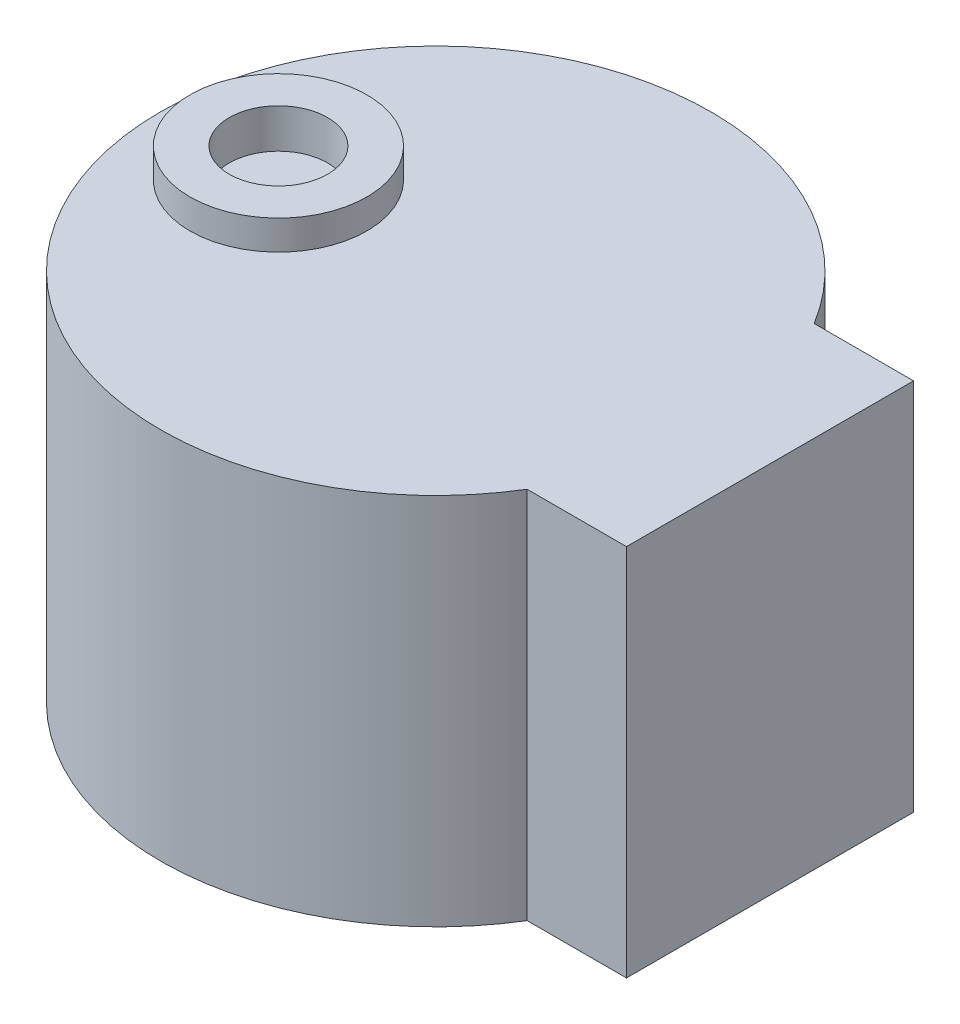
ISO-10303-21;
HEADER;
FILE_DESCRIPTION(('STEP AP214'),'2;1');
FILE_NAME('part.step','',(''),(''),'','','');
FILE_SCHEMA(('AUTOMOTIVE_DESIGN { 1 0 10303 214 1 1 1 1 }'));
ENDSEC;
DATA;
#1=APPLICATION_CONTEXT('core data for automotive mechanical design processes');
#2=APPLICATION_PROTOCOL_DEFINITION('international standard','automotive_design',2000,#1);
#3=PRODUCT_CONTEXT('',#1,'mechanical');
#4=PRODUCT('Part','Part','',(#3));
#5=PRODUCT_RELATED_PRODUCT_CATEGORY('part','',(#4));
#6=PRODUCT_DEFINITION_FORMATION('','',#4);
#7=PRODUCT_DEFINITION_CONTEXT('part definition',#1,'design');
#8=PRODUCT_DEFINITION('design','',#6,#7);
#9=PRODUCT_DEFINITION_SHAPE('','',#8);
#10=(LENGTH_UNIT() NAMED_UNIT(*) SI_UNIT(.MILLI.,.METRE.));
#11=(NAMED_UNIT(*) PLANE_ANGLE_UNIT() SI_UNIT($,.RADIAN.));
#12=(NAMED_UNIT(*) SI_UNIT($,.STERADIAN.) SOLID_ANGLE_UNIT());
#13=UNCERTAINTY_MEASURE_WITH_UNIT(LENGTH_MEASURE(1.E-05),#10,'distance_accuracy_value','');
#14=(GEOMETRIC_REPRESENTATION_CONTEXT(3) GLOBAL_UNCERTAINTY_ASSIGNED_CONTEXT((#13)) GLOBAL_UNIT_ASSIGNED_CONTEXT((#10,
#11,#12)) REPRESENTATION_CONTEXT('',''));
#15=CARTESIAN_POINT('',(0.,0.,0.));
#16=DIRECTION('',(0.,0.,1.));
#17=DIRECTION('',(1.,0.,0.));
#18=AXIS2_PLACEMENT_3D('',#15,#16,#17);
#19=CARTESIAN_POINT('',(0.,19.,-7.3));
#20=DIRECTION('',(0.,0.,-1.));
#21=DIRECTION('',(-1.,0.,0.));
#22=AXIS2_PLACEMENT_3D('',#19,#20,#21);
#23=PLANE('',#22);
#24=DIRECTION('',(1.,0.,0.));
#25=VECTOR('',#24,1.);
#26=CARTESIAN_POINT('',(0.,0.,-7.3));
#27=LINE('',#26,#25);
#28=CARTESIAN_POINT('',(11.9461290801665,0.,-7.3));
#29=VERTEX_POINT('',#28);
#30=CARTESIAN_POINT('',(17.,0.,-7.3));
#31=VERTEX_POINT('',#30);
#32=EDGE_CURVE('E107',#29,#31,#27,.T.);
#33=ORIENTED_EDGE('',*,*,#32,.F.);
#34=DIRECTION('',(0.,-1.,0.));
#35=VECTOR('',#34,1.);
#36=CARTESIAN_POINT('',(11.9461290801665,19.,-7.3));
#37=LINE('',#36,#35);
#38=CARTESIAN_POINT('',(11.9461290801665,19.,-7.3));
#39=VERTEX_POINT('',#38);
#40=EDGE_CURVE('E11',#39,#29,#37,.T.);
#41=ORIENTED_EDGE('',*,*,#40,.F.);
#42=DIRECTION('',(1.,0.,0.));
#43=VECTOR('',#42,1.);
#44=CARTESIAN_POINT('',(0.,19.,-7.3));
#45=LINE('',#44,#43);
#46=CARTESIAN_POINT('',(17.,19.,-7.3));
#47=VERTEX_POINT('',#46);
#48=EDGE_CURVE('E91',#39,#47,#45,.T.);
#49=ORIENTED_EDGE('',*,*,#48,.T.);
#50=DIRECTION('',(0.,-1.,0.));
#51=VECTOR('',#50,1.);
#52=CARTESIAN_POINT('',(17.,19.,-7.3));
#53=LINE('',#52,#51);
#54=EDGE_CURVE('E80',#47,#31,#53,.T.);
#55=ORIENTED_EDGE('',*,*,#54,.T.);
#56=EDGE_LOOP('',(#33,#41,#49,#55));
#57=FACE_BOUND('',#56,.T.);
#58=ADVANCED_FACE('F40',(#57),#23,.T.);
#59=CARTESIAN_POINT('',(0.,19.,0.));
#60=DIRECTION('',(0.,-1.,0.));
#61=DIRECTION('',(0.,0.,-1.));
#62=AXIS2_PLACEMENT_3D('',#59,#60,#61);
#63=CYLINDRICAL_SURFACE('',#62,14.);
#64=CARTESIAN_POINT('',(0.,0.,0.));
#65=DIRECTION('',(0.,1.,0.));
#66=DIRECTION('',(0.,0.,1.));
#67=AXIS2_PLACEMENT_3D('',#64,#65,#66);
#68=CIRCLE('',#67,14.);
#69=CARTESIAN_POINT('',(11.9461290801665,0.,7.3));
#70=VERTEX_POINT('',#69);
#71=EDGE_CURVE('E97',#29,#70,#68,.T.);
#72=ORIENTED_EDGE('',*,*,#71,.T.);
#73=DIRECTION('',(0.,-1.,0.));
#74=VECTOR('',#73,1.);
#75=CARTESIAN_POINT('',(11.9461290801665,19.,7.3));
#76=LINE('',#75,#74);
#77=CARTESIAN_POINT('',(11.9461290801665,19.,7.3));
#78=VERTEX_POINT('',#77);
#79=EDGE_CURVE('E49',#78,#70,#76,.T.);
#80=ORIENTED_EDGE('',*,*,#79,.F.);
#81=CARTESIAN_POINT('',(0.,19.,0.));
#82=DIRECTION('',(0.,1.,0.));
#83=DIRECTION('',(0.,0.,1.));
#84=AXIS2_PLACEMENT_3D('',#81,#82,#83);
#85=CIRCLE('',#84,14.);
#86=EDGE_CURVE('E86',#39,#78,#85,.T.);
#87=ORIENTED_EDGE('',*,*,#86,.F.);
#88=ORIENTED_EDGE('',*,*,#40,.T.);
#89=EDGE_LOOP('',(#72,#80,#87,#88));
#90=FACE_BOUND('',#89,.T.);
#91=ADVANCED_FACE('F95',(#90),#63,.T.);
#92=CARTESIAN_POINT('',(0.,19.,7.3));
#93=DIRECTION('',(0.,0.,-1.));
#94=DIRECTION('',(-1.,0.,0.));
#95=AXIS2_PLACEMENT_3D('',#92,#93,#94);
#96=PLANE('',#95);
#97=DIRECTION('',(1.,0.,0.));
#98=VECTOR('',#97,1.);
#99=CARTESIAN_POINT('',(0.,0.,7.3));
#100=LINE('',#99,#98);
#101=CARTESIAN_POINT('',(17.,0.,7.3));
#102=VERTEX_POINT('',#101);
#103=EDGE_CURVE('E73',#70,#102,#100,.T.);
#104=ORIENTED_EDGE('',*,*,#103,.T.);
#105=DIRECTION('',(0.,-1.,0.));
#106=VECTOR('',#105,1.);
#107=CARTESIAN_POINT('',(17.,19.,7.3));
#108=LINE('',#107,#106);
#109=CARTESIAN_POINT('',(17.,19.,7.3));
#110=VERTEX_POINT('',#109);
#111=EDGE_CURVE('E99',#110,#102,#108,.T.);
#112=ORIENTED_EDGE('',*,*,#111,.F.);
#113=DIRECTION('',(1.,0.,0.));
#114=VECTOR('',#113,1.);
#115=CARTESIAN_POINT('',(0.,19.,7.3));
#116=LINE('',#115,#114);
#117=EDGE_CURVE('E90',#78,#110,#116,.T.);
#118=ORIENTED_EDGE('',*,*,#117,.F.);
#119=ORIENTED_EDGE('',*,*,#79,.T.);
#120=EDGE_LOOP('',(#104,#112,#118,#119));
#121=FACE_BOUND('',#120,.T.);
#122=ADVANCED_FACE('F100',(#121),#96,.F.);
#123=CARTESIAN_POINT('',(17.,19.,0.));
#124=DIRECTION('',(-1.,0.,0.));
#125=DIRECTION('',(0.,0.,1.));
#126=AXIS2_PLACEMENT_3D('',#123,#124,#125);
#127=PLANE('',#126);
#128=DIRECTION('',(0.,0.,-1.));
#129=VECTOR('',#128,1.);
#130=CARTESIAN_POINT('',(17.,0.,0.));
#131=LINE('',#130,#129);
#132=EDGE_CURVE('E116',#102,#31,#131,.T.);
#133=ORIENTED_EDGE('',*,*,#132,.T.);
#134=ORIENTED_EDGE('',*,*,#54,.F.);
#135=DIRECTION('',(0.,0.,-1.));
#136=VECTOR('',#135,1.);
#137=CARTESIAN_POINT('',(17.,19.,0.));
#138=LINE('',#137,#136);
#139=EDGE_CURVE('E57',#110,#47,#138,.T.);
#140=ORIENTED_EDGE('',*,*,#139,.F.);
#141=ORIENTED_EDGE('',*,*,#111,.T.);
#142=EDGE_LOOP('',(#133,#134,#140,#141));
#143=FACE_BOUND('',#142,.T.);
#144=ADVANCED_FACE('F124',(#143),#127,.F.);
#145=CARTESIAN_POINT('',(0.,19.,0.));
#146=DIRECTION('',(0.,1.,0.));
#147=DIRECTION('',(0.,0.,1.));
#148=AXIS2_PLACEMENT_3D('',#145,#146,#147);
#149=PLANE('',#148);
#150=CARTESIAN_POINT('',(-8.,19.,0.));
#151=DIRECTION('',(0.,1.,0.));
#152=DIRECTION('',(0.,0.,1.));
#153=AXIS2_PLACEMENT_3D('',#150,#151,#152);
#154=CIRCLE('',#153,4.5);
#155=CARTESIAN_POINT('',(-8.,19.,4.5));
#156=VERTEX_POINT('',#155);
#157=EDGE_CURVE('E169',#156,#156,#154,.T.);
#158=ORIENTED_EDGE('',*,*,#157,.F.);
#159=EDGE_LOOP('',(#158));
#160=FACE_BOUND('',#159,.T.);
#161=ORIENTED_EDGE('',*,*,#48,.F.);
#162=ORIENTED_EDGE('',*,*,#86,.T.);
#163=ORIENTED_EDGE('',*,*,#117,.T.);
#164=ORIENTED_EDGE('',*,*,#139,.T.);
#165=EDGE_LOOP('',(#161,#162,#163,#164));
#166=FACE_BOUND('',#165,.T.);
#167=ADVANCED_FACE('F88',(#160,#166),#149,.T.);
#168=CARTESIAN_POINT('',(0.,0.,0.));
#169=DIRECTION('',(0.,1.,0.));
#170=DIRECTION('',(0.,0.,1.));
#171=AXIS2_PLACEMENT_3D('',#168,#169,#170);
#172=PLANE('',#171);
#173=ORIENTED_EDGE('',*,*,#32,.T.);
#174=ORIENTED_EDGE('',*,*,#132,.F.);
#175=ORIENTED_EDGE('',*,*,#103,.F.);
#176=ORIENTED_EDGE('',*,*,#71,.F.);
#177=EDGE_LOOP('',(#173,#174,#175,#176));
#178=FACE_BOUND('',#177,.T.);
#179=ADVANCED_FACE('F126',(#178),#172,.F.);
#180=CARTESIAN_POINT('',(-8.,20.5,0.));
#181=DIRECTION('',(0.,-1.,0.));
#182=DIRECTION('',(0.,0.,-1.));
#183=AXIS2_PLACEMENT_3D('',#180,#181,#182);
#184=CYLINDRICAL_SURFACE('',#183,4.5);
#185=CARTESIAN_POINT('',(-8.,20.5,0.));
#186=DIRECTION('',(0.,1.,0.));
#187=DIRECTION('',(0.,0.,1.));
#188=AXIS2_PLACEMENT_3D('',#185,#186,#187);
#189=CIRCLE('',#188,4.5);
#190=CARTESIAN_POINT('',(-8.,20.5,4.5));
#191=VERTEX_POINT('',#190);
#192=EDGE_CURVE('E111',#191,#191,#189,.T.);
#193=ORIENTED_EDGE('',*,*,#192,.F.);
#194=EDGE_LOOP('',(#193));
#195=FACE_BOUND('',#194,.T.);
#196=ORIENTED_EDGE('',*,*,#157,.T.);
#197=EDGE_LOOP('',(#196));
#198=FACE_BOUND('',#197,.T.);
#199=ADVANCED_FACE('F140',(#195,#198),#184,.T.);
#200=CARTESIAN_POINT('',(-8.,20.5,0.));
#201=DIRECTION('',(0.,1.,0.));
#202=DIRECTION('',(0.,0.,1.));
#203=AXIS2_PLACEMENT_3D('',#200,#201,#202);
#204=PLANE('',#203);
#205=CARTESIAN_POINT('',(-8.,20.5,0.));
#206=DIRECTION('',(0.,1.,0.));
#207=DIRECTION('',(0.,0.,1.));
#208=AXIS2_PLACEMENT_3D('',#205,#206,#207);
#209=CIRCLE('',#208,2.5);
#210=CARTESIAN_POINT('',(-8.,20.5,2.5));
#211=VERTEX_POINT('',#210);
#212=EDGE_CURVE('E165',#211,#211,#209,.F.);
#213=ORIENTED_EDGE('',*,*,#212,.T.);
#214=EDGE_LOOP('',(#213));
#215=FACE_BOUND('',#214,.T.);
#216=ORIENTED_EDGE('',*,*,#192,.T.);
#217=EDGE_LOOP('',(#216));
#218=FACE_BOUND('',#217,.T.);
#219=ADVANCED_FACE('F146',(#215,#218),#204,.T.);
#220=CARTESIAN_POINT('',(-8.,30.5,0.));
#221=DIRECTION('',(0.,-1.,0.));
#222=DIRECTION('',(0.,0.,-1.));
#223=AXIS2_PLACEMENT_3D('',#220,#221,#222);
#224=CYLINDRICAL_SURFACE('',#223,2.5);
#225=ORIENTED_EDGE('',*,*,#212,.F.);
#226=EDGE_LOOP('',(#225));
#227=FACE_BOUND('',#226,.T.);
#228=CARTESIAN_POINT('',(-8.,18.5,0.));
#229=DIRECTION('',(0.,1.,0.));
#230=DIRECTION('',(0.,0.,1.));
#231=AXIS2_PLACEMENT_3D('',#228,#229,#230);
#232=CIRCLE('',#231,2.5);
#233=CARTESIAN_POINT('',(-8.,18.5,2.5));
#234=VERTEX_POINT('',#233);
#235=EDGE_CURVE('E162',#234,#234,#232,.T.);
#236=ORIENTED_EDGE('',*,*,#235,.F.);
#237=EDGE_LOOP('',(#236));
#238=FACE_BOUND('',#237,.T.);
#239=ADVANCED_FACE('F150',(#227,#238),#224,.F.);
#240=CARTESIAN_POINT('',(-8.,18.5,0.));
#241=DIRECTION('',(0.,1.,0.));
#242=DIRECTION('',(0.,0.,1.));
#243=AXIS2_PLACEMENT_3D('',#240,#241,#242);
#244=PLANE('',#243);
#245=ORIENTED_EDGE('',*,*,#235,.T.);
#246=EDGE_LOOP('',(#245));
#247=FACE_BOUND('',#246,.T.);
#248=ADVANCED_FACE('F154',(#247),#244,.T.);
#249=CLOSED_SHELL('',(#58,#91,#122,#144,#167,#179,#199,#219,#239,#248));
#250=MANIFOLD_SOLID_BREP('B2',#249);
#251=ADVANCED_BREP_SHAPE_REPRESENTATION('',(#18,#250),#14);
#252=SHAPE_DEFINITION_REPRESENTATION(#9,#251);
ENDSEC;
END-ISO-10303-21;
